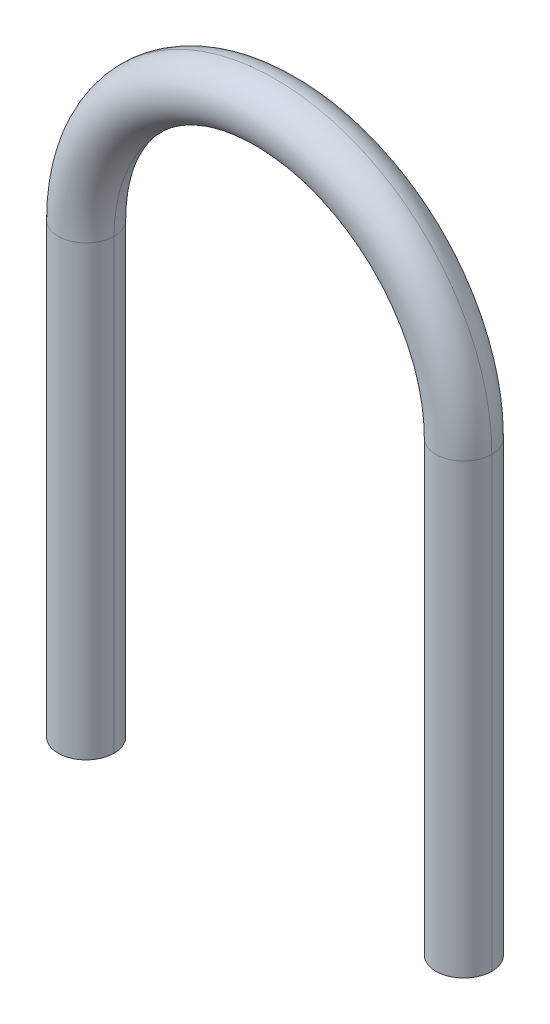
ISO-10303-21;
HEADER;
FILE_DESCRIPTION(('STEP AP214'),'2;1');
FILE_NAME('part.step','',(''),(''),'','','');
FILE_SCHEMA(('AUTOMOTIVE_DESIGN { 1 0 10303 214 1 1 1 1 }'));
ENDSEC;
DATA;
#1=APPLICATION_CONTEXT('core data for automotive mechanical design processes');
#2=APPLICATION_PROTOCOL_DEFINITION('international standard','automotive_design',2000,#1);
#3=PRODUCT_CONTEXT('',#1,'mechanical');
#4=PRODUCT('Part','Part','',(#3));
#5=PRODUCT_RELATED_PRODUCT_CATEGORY('part','',(#4));
#6=PRODUCT_DEFINITION_FORMATION('','',#4);
#7=PRODUCT_DEFINITION_CONTEXT('part definition',#1,'design');
#8=PRODUCT_DEFINITION('design','',#6,#7);
#9=PRODUCT_DEFINITION_SHAPE('','',#8);
#10=(LENGTH_UNIT() NAMED_UNIT(*) SI_UNIT(.MILLI.,.METRE.));
#11=(NAMED_UNIT(*) PLANE_ANGLE_UNIT() SI_UNIT($,.RADIAN.));
#12=(NAMED_UNIT(*) SI_UNIT($,.STERADIAN.) SOLID_ANGLE_UNIT());
#13=UNCERTAINTY_MEASURE_WITH_UNIT(LENGTH_MEASURE(1.E-05),#10,'distance_accuracy_value','');
#14=(GEOMETRIC_REPRESENTATION_CONTEXT(3) GLOBAL_UNCERTAINTY_ASSIGNED_CONTEXT((#13)) GLOBAL_UNIT_ASSIGNED_CONTEXT((#10,
#11,#12)) REPRESENTATION_CONTEXT('',''));
#15=CARTESIAN_POINT('',(0.,0.,0.));
#16=DIRECTION('',(0.,0.,1.));
#17=DIRECTION('',(1.,0.,0.));
#18=AXIS2_PLACEMENT_3D('',#15,#16,#17);
#19=CARTESIAN_POINT('',(0.,0.,0.));
#20=DIRECTION('',(0.,-1.,0.));
#21=DIRECTION('',(0.,0.,-1.));
#22=AXIS2_PLACEMENT_3D('',#19,#20,#21);
#23=PLANE('',#22);
#24=CARTESIAN_POINT('',(0.,0.,0.));
#25=DIRECTION('',(0.,-1.,0.));
#26=DIRECTION('',(0.,0.,-1.));
#27=AXIS2_PLACEMENT_3D('',#24,#25,#26);
#28=CIRCLE('',#27,12.7);
#29=CARTESIAN_POINT('',(-12.7,0.,0.));
#30=VERTEX_POINT('',#29);
#31=CARTESIAN_POINT('',(12.7,0.,0.));
#32=VERTEX_POINT('',#31);
#33=EDGE_CURVE('E83',#30,#32,#28,.T.);
#34=ORIENTED_EDGE('',*,*,#33,.T.);
#35=CARTESIAN_POINT('',(0.,0.,0.));
#36=DIRECTION('',(0.,-1.,0.));
#37=DIRECTION('',(0.,0.,1.));
#38=AXIS2_PLACEMENT_3D('',#35,#36,#37);
#39=CIRCLE('',#38,12.7);
#40=EDGE_CURVE('E74',#32,#30,#39,.T.);
#41=ORIENTED_EDGE('',*,*,#40,.T.);
#42=EDGE_LOOP('',(#34,#41));
#43=FACE_BOUND('',#42,.T.);
#44=ADVANCED_FACE('F35',(#43),#23,.T.);
#45=CARTESIAN_POINT('',(171.45,0.,0.));
#46=DIRECTION('',(0.,1.,0.));
#47=DIRECTION('',(0.,0.,-1.));
#48=AXIS2_PLACEMENT_3D('',#45,#46,#47);
#49=PLANE('',#48);
#50=CARTESIAN_POINT('',(171.45,0.,0.));
#51=DIRECTION('',(0.,1.,0.));
#52=DIRECTION('',(0.,0.,-1.));
#53=AXIS2_PLACEMENT_3D('',#50,#51,#52);
#54=CIRCLE('',#53,12.7);
#55=CARTESIAN_POINT('',(184.15,0.,0.));
#56=VERTEX_POINT('',#55);
#57=CARTESIAN_POINT('',(158.75,0.,0.));
#58=VERTEX_POINT('',#57);
#59=EDGE_CURVE('E11',#56,#58,#54,.T.);
#60=ORIENTED_EDGE('',*,*,#59,.F.);
#61=CARTESIAN_POINT('',(171.45,0.,0.));
#62=DIRECTION('',(0.,1.,0.));
#63=DIRECTION('',(0.,0.,1.));
#64=AXIS2_PLACEMENT_3D('',#61,#62,#63);
#65=CIRCLE('',#64,12.7);
#66=EDGE_CURVE('E49',#58,#56,#65,.T.);
#67=ORIENTED_EDGE('',*,*,#66,.F.);
#68=EDGE_LOOP('',(#60,#67));
#69=FACE_BOUND('',#68,.T.);
#70=ADVANCED_FACE('F135',(#69),#49,.F.);
#71=CARTESIAN_POINT('',(0.,0.,0.));
#72=DIRECTION('',(0.,1.,0.));
#73=DIRECTION('',(0.,0.,1.));
#74=AXIS2_PLACEMENT_3D('',#71,#72,#73);
#75=CYLINDRICAL_SURFACE('',#74,12.7);
#76=DIRECTION('',(0.,1.,0.));
#77=VECTOR('',#76,1.);
#78=CARTESIAN_POINT('',(-12.7,0.,0.));
#79=LINE('',#78,#77);
#80=CARTESIAN_POINT('',(-12.7,203.2,0.));
#81=VERTEX_POINT('',#80);
#82=EDGE_CURVE('E81',#30,#81,#79,.T.);
#83=ORIENTED_EDGE('',*,*,#82,.F.);
#84=ORIENTED_EDGE('',*,*,#40,.F.);
#85=DIRECTION('',(0.,1.,0.));
#86=VECTOR('',#85,1.);
#87=CARTESIAN_POINT('',(12.7,0.,0.));
#88=LINE('',#87,#86);
#89=CARTESIAN_POINT('',(12.7,203.2,0.));
#90=VERTEX_POINT('',#89);
#91=EDGE_CURVE('E79',#32,#90,#88,.T.);
#92=ORIENTED_EDGE('',*,*,#91,.T.);
#93=CARTESIAN_POINT('',(0.,203.2,0.));
#94=DIRECTION('',(0.,-1.,0.));
#95=DIRECTION('',(0.,0.,1.));
#96=AXIS2_PLACEMENT_3D('',#93,#94,#95);
#97=CIRCLE('',#96,12.7);
#98=EDGE_CURVE('E92',#90,#81,#97,.T.);
#99=ORIENTED_EDGE('',*,*,#98,.T.);
#100=EDGE_LOOP('',(#83,#84,#92,#99));
#101=FACE_BOUND('',#100,.T.);
#102=ADVANCED_FACE('F76',(#101),#75,.T.);
#103=CARTESIAN_POINT('',(0.,0.,0.));
#104=DIRECTION('',(0.,1.,0.));
#105=DIRECTION('',(0.,0.,1.));
#106=AXIS2_PLACEMENT_3D('',#103,#104,#105);
#107=CYLINDRICAL_SURFACE('',#106,12.7);
#108=CARTESIAN_POINT('',(0.,203.2,0.));
#109=DIRECTION('',(0.,-1.,0.));
#110=DIRECTION('',(0.,0.,-1.));
#111=AXIS2_PLACEMENT_3D('',#108,#109,#110);
#112=CIRCLE('',#111,12.7);
#113=EDGE_CURVE('E90',#81,#90,#112,.T.);
#114=ORIENTED_EDGE('',*,*,#113,.T.);
#115=ORIENTED_EDGE('',*,*,#91,.F.);
#116=ORIENTED_EDGE('',*,*,#33,.F.);
#117=ORIENTED_EDGE('',*,*,#82,.T.);
#118=EDGE_LOOP('',(#114,#115,#116,#117));
#119=FACE_BOUND('',#118,.T.);
#120=ADVANCED_FACE('F88',(#119),#107,.T.);
#121=CARTESIAN_POINT('',(85.725,203.2,0.));
#122=DIRECTION('',(0.,0.,-1.));
#123=DIRECTION('',(-1.,0.,0.));
#124=AXIS2_PLACEMENT_3D('',#121,#122,#123);
#125=TOROIDAL_SURFACE('',#124,85.725,12.7);
#126=CARTESIAN_POINT('',(85.725,203.2,0.));
#127=DIRECTION('',(0.,0.,-1.));
#128=DIRECTION('',(-1.,0.,0.));
#129=AXIS2_PLACEMENT_3D('',#126,#127,#128);
#130=CIRCLE('',#129,98.425);
#131=CARTESIAN_POINT('',(184.15,203.2,0.));
#132=VERTEX_POINT('',#131);
#133=EDGE_CURVE('E100',#81,#132,#130,.T.);
#134=ORIENTED_EDGE('',*,*,#133,.F.);
#135=ORIENTED_EDGE('',*,*,#98,.F.);
#136=CARTESIAN_POINT('',(85.725,203.2,0.));
#137=DIRECTION('',(0.,0.,-1.));
#138=DIRECTION('',(-1.,0.,0.));
#139=AXIS2_PLACEMENT_3D('',#136,#137,#138);
#140=CIRCLE('',#139,73.025);
#141=CARTESIAN_POINT('',(158.75,203.2,0.));
#142=VERTEX_POINT('',#141);
#143=EDGE_CURVE('E101',#90,#142,#140,.T.);
#144=ORIENTED_EDGE('',*,*,#143,.T.);
#145=CARTESIAN_POINT('',(171.45,203.2,0.));
#146=DIRECTION('',(0.,1.,0.));
#147=DIRECTION('',(0.,0.,1.));
#148=AXIS2_PLACEMENT_3D('',#145,#146,#147);
#149=CIRCLE('',#148,12.7);
#150=EDGE_CURVE('E97',#142,#132,#149,.T.);
#151=ORIENTED_EDGE('',*,*,#150,.T.);
#152=EDGE_LOOP('',(#134,#135,#144,#151));
#153=FACE_BOUND('',#152,.T.);
#154=ADVANCED_FACE('F118',(#153),#125,.T.);
#155=CARTESIAN_POINT('',(85.725,203.2,0.));
#156=DIRECTION('',(0.,0.,-1.));
#157=DIRECTION('',(-1.,0.,0.));
#158=AXIS2_PLACEMENT_3D('',#155,#156,#157);
#159=TOROIDAL_SURFACE('',#158,85.725,12.7);
#160=CARTESIAN_POINT('',(171.45,203.2,0.));
#161=DIRECTION('',(0.,1.,0.));
#162=DIRECTION('',(0.,0.,-1.));
#163=AXIS2_PLACEMENT_3D('',#160,#161,#162);
#164=CIRCLE('',#163,12.7);
#165=EDGE_CURVE('E104',#132,#142,#164,.T.);
#166=ORIENTED_EDGE('',*,*,#165,.T.);
#167=ORIENTED_EDGE('',*,*,#143,.F.);
#168=ORIENTED_EDGE('',*,*,#113,.F.);
#169=ORIENTED_EDGE('',*,*,#133,.T.);
#170=EDGE_LOOP('',(#166,#167,#168,#169));
#171=FACE_BOUND('',#170,.T.);
#172=ADVANCED_FACE('F115',(#171),#159,.T.);
#173=CARTESIAN_POINT('',(171.45,203.2,0.));
#174=DIRECTION('',(0.,-1.,0.));
#175=DIRECTION('',(0.,0.,-1.));
#176=AXIS2_PLACEMENT_3D('',#173,#174,#175);
#177=CYLINDRICAL_SURFACE('',#176,12.7);
#178=DIRECTION('',(0.,-1.,0.));
#179=VECTOR('',#178,1.);
#180=CARTESIAN_POINT('',(184.15,203.2,0.));
#181=LINE('',#180,#179);
#182=EDGE_CURVE('E42',#132,#56,#181,.T.);
#183=ORIENTED_EDGE('',*,*,#182,.F.);
#184=ORIENTED_EDGE('',*,*,#150,.F.);
#185=DIRECTION('',(0.,-1.,0.));
#186=VECTOR('',#185,1.);
#187=CARTESIAN_POINT('',(158.75,203.2,0.));
#188=LINE('',#187,#186);
#189=EDGE_CURVE('E108',#142,#58,#188,.T.);
#190=ORIENTED_EDGE('',*,*,#189,.T.);
#191=ORIENTED_EDGE('',*,*,#66,.T.);
#192=EDGE_LOOP('',(#183,#184,#190,#191));
#193=FACE_BOUND('',#192,.T.);
#194=ADVANCED_FACE('F116',(#193),#177,.T.);
#195=CARTESIAN_POINT('',(171.45,203.2,0.));
#196=DIRECTION('',(0.,-1.,0.));
#197=DIRECTION('',(0.,0.,-1.));
#198=AXIS2_PLACEMENT_3D('',#195,#196,#197);
#199=CYLINDRICAL_SURFACE('',#198,12.7);
#200=ORIENTED_EDGE('',*,*,#59,.T.);
#201=ORIENTED_EDGE('',*,*,#189,.F.);
#202=ORIENTED_EDGE('',*,*,#165,.F.);
#203=ORIENTED_EDGE('',*,*,#182,.T.);
#204=EDGE_LOOP('',(#200,#201,#202,#203));
#205=FACE_BOUND('',#204,.T.);
#206=ADVANCED_FACE('F129',(#205),#199,.T.);
#207=CLOSED_SHELL('',(#44,#70,#102,#120,#154,#172,#194,#206));
#208=MANIFOLD_SOLID_BREP('B2',#207);
#209=ADVANCED_BREP_SHAPE_REPRESENTATION('',(#18,#208),#14);
#210=SHAPE_DEFINITION_REPRESENTATION(#9,#209);
ENDSEC;
END-ISO-10303-21;
